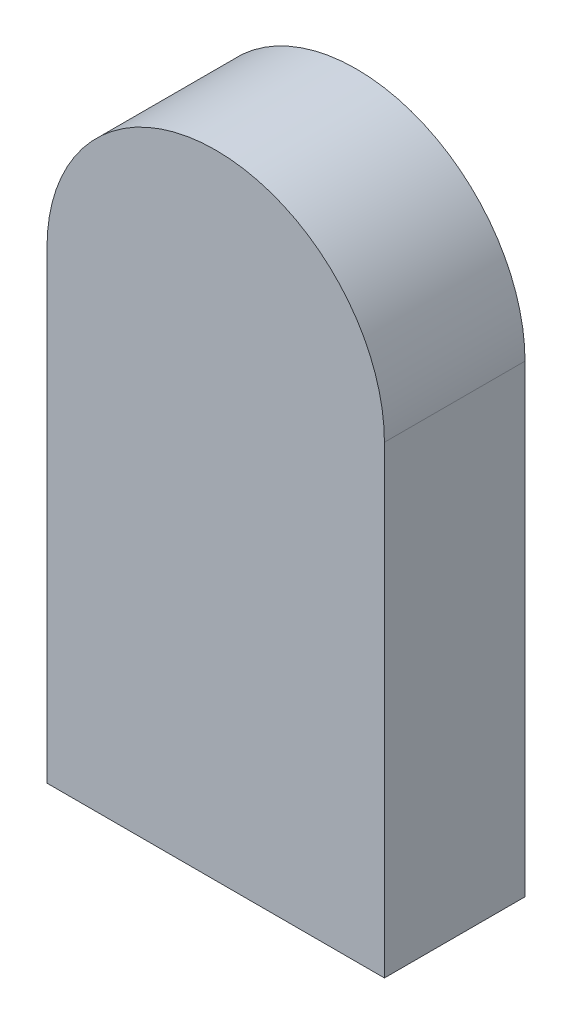
ISO-10303-21;
HEADER;
FILE_DESCRIPTION(('STEP AP214'),'2;1');
FILE_NAME('part.step','',(''),(''),'','','');
FILE_SCHEMA(('AUTOMOTIVE_DESIGN { 1 0 10303 214 1 1 1 1 }'));
ENDSEC;
DATA;
#1=APPLICATION_CONTEXT('core data for automotive mechanical design processes');
#2=APPLICATION_PROTOCOL_DEFINITION('international standard','automotive_design',2000,#1);
#3=PRODUCT_CONTEXT('',#1,'mechanical');
#4=PRODUCT('Part','Part','',(#3));
#5=PRODUCT_RELATED_PRODUCT_CATEGORY('part','',(#4));
#6=PRODUCT_DEFINITION_FORMATION('','',#4);
#7=PRODUCT_DEFINITION_CONTEXT('part definition',#1,'design');
#8=PRODUCT_DEFINITION('design','',#6,#7);
#9=PRODUCT_DEFINITION_SHAPE('','',#8);
#10=(LENGTH_UNIT() NAMED_UNIT(*) SI_UNIT(.MILLI.,.METRE.));
#11=(NAMED_UNIT(*) PLANE_ANGLE_UNIT() SI_UNIT($,.RADIAN.));
#12=(NAMED_UNIT(*) SI_UNIT($,.STERADIAN.) SOLID_ANGLE_UNIT());
#13=UNCERTAINTY_MEASURE_WITH_UNIT(LENGTH_MEASURE(1.E-05),#10,'distance_accuracy_value','');
#14=(GEOMETRIC_REPRESENTATION_CONTEXT(3) GLOBAL_UNCERTAINTY_ASSIGNED_CONTEXT((#13)) GLOBAL_UNIT_ASSIGNED_CONTEXT((#10,
#11,#12)) REPRESENTATION_CONTEXT('',''));
#15=CARTESIAN_POINT('',(0.,0.,0.));
#16=DIRECTION('',(0.,0.,1.));
#17=DIRECTION('',(1.,0.,0.));
#18=AXIS2_PLACEMENT_3D('',#15,#16,#17);
#19=CARTESIAN_POINT('',(-3.37,-4.05,0.));
#20=DIRECTION('',(0.,1.,0.));
#21=DIRECTION('',(1.,0.,0.));
#22=AXIS2_PLACEMENT_3D('',#19,#20,#21);
#23=PLANE('',#22);
#24=DIRECTION('',(1.,0.,0.));
#25=VECTOR('',#24,1.);
#26=CARTESIAN_POINT('',(-3.37,-4.05,0.));
#27=LINE('',#26,#25);
#28=CARTESIAN_POINT('',(-3.37,-4.05,0.));
#29=VERTEX_POINT('',#28);
#30=CARTESIAN_POINT('',(-3.13,-4.05,0.));
#31=VERTEX_POINT('',#30);
#32=EDGE_CURVE('E11',#29,#31,#27,.T.);
#33=ORIENTED_EDGE('',*,*,#32,.T.);
#34=DIRECTION('',(0.,0.,1.));
#35=VECTOR('',#34,1.);
#36=CARTESIAN_POINT('',(-3.13,-4.05,0.));
#37=LINE('',#36,#35);
#38=CARTESIAN_POINT('',(-3.13,-4.05,0.1));
#39=VERTEX_POINT('',#38);
#40=EDGE_CURVE('E24',#31,#39,#37,.T.);
#41=ORIENTED_EDGE('',*,*,#40,.T.);
#42=DIRECTION('',(1.,0.,0.));
#43=VECTOR('',#42,1.);
#44=CARTESIAN_POINT('',(-3.37,-4.05,0.1));
#45=LINE('',#44,#43);
#46=CARTESIAN_POINT('',(-3.37,-4.05,0.1));
#47=VERTEX_POINT('',#46);
#48=EDGE_CURVE('E87',#47,#39,#45,.T.);
#49=ORIENTED_EDGE('',*,*,#48,.F.);
#50=DIRECTION('',(0.,0.,1.));
#51=VECTOR('',#50,1.);
#52=CARTESIAN_POINT('',(-3.37,-4.05,0.));
#53=LINE('',#52,#51);
#54=EDGE_CURVE('E36',#29,#47,#53,.T.);
#55=ORIENTED_EDGE('',*,*,#54,.F.);
#56=EDGE_LOOP('',(#33,#41,#49,#55));
#57=FACE_BOUND('',#56,.T.);
#58=ADVANCED_FACE('F17',(#57),#23,.F.);
#59=CARTESIAN_POINT('',(-3.13,-4.05,0.));
#60=DIRECTION('',(-1.,0.,0.));
#61=DIRECTION('',(0.,1.,0.));
#62=AXIS2_PLACEMENT_3D('',#59,#60,#61);
#63=PLANE('',#62);
#64=DIRECTION('',(0.,1.,0.));
#65=VECTOR('',#64,1.);
#66=CARTESIAN_POINT('',(-3.13,-4.05,0.));
#67=LINE('',#66,#65);
#68=CARTESIAN_POINT('',(-3.13,-3.72,0.));
#69=VERTEX_POINT('',#68);
#70=EDGE_CURVE('E84',#31,#69,#67,.T.);
#71=ORIENTED_EDGE('',*,*,#70,.T.);
#72=DIRECTION('',(0.,0.,1.));
#73=VECTOR('',#72,1.);
#74=CARTESIAN_POINT('',(-3.13,-3.72,0.));
#75=LINE('',#74,#73);
#76=CARTESIAN_POINT('',(-3.13,-3.72,0.1));
#77=VERTEX_POINT('',#76);
#78=EDGE_CURVE('E82',#69,#77,#75,.T.);
#79=ORIENTED_EDGE('',*,*,#78,.T.);
#80=DIRECTION('',(0.,1.,0.));
#81=VECTOR('',#80,1.);
#82=CARTESIAN_POINT('',(-3.13,-4.05,0.1));
#83=LINE('',#82,#81);
#84=EDGE_CURVE('E72',#39,#77,#83,.T.);
#85=ORIENTED_EDGE('',*,*,#84,.F.);
#86=ORIENTED_EDGE('',*,*,#40,.F.);
#87=EDGE_LOOP('',(#71,#79,#85,#86));
#88=FACE_BOUND('',#87,.T.);
#89=ADVANCED_FACE('F89',(#88),#63,.F.);
#90=CARTESIAN_POINT('',(-3.25,-3.72,0.));
#91=DIRECTION('',(0.,0.,-1.));
#92=DIRECTION('',(1.,0.,0.));
#93=AXIS2_PLACEMENT_3D('',#90,#91,#92);
#94=CYLINDRICAL_SURFACE('',#93,0.12);
#95=CARTESIAN_POINT('',(-3.25,-3.72,0.));
#96=DIRECTION('',(0.,0.,1.));
#97=DIRECTION('',(1.,0.,0.));
#98=AXIS2_PLACEMENT_3D('',#95,#96,#97);
#99=CIRCLE('',#98,0.12);
#100=CARTESIAN_POINT('',(-3.37,-3.72,0.));
#101=VERTEX_POINT('',#100);
#102=EDGE_CURVE('E62',#69,#101,#99,.T.);
#103=ORIENTED_EDGE('',*,*,#102,.T.);
#104=DIRECTION('',(0.,0.,1.));
#105=VECTOR('',#104,1.);
#106=CARTESIAN_POINT('',(-3.37,-3.72,0.));
#107=LINE('',#106,#105);
#108=CARTESIAN_POINT('',(-3.37,-3.72,0.1));
#109=VERTEX_POINT('',#108);
#110=EDGE_CURVE('E57',#101,#109,#107,.T.);
#111=ORIENTED_EDGE('',*,*,#110,.T.);
#112=CARTESIAN_POINT('',(-3.25,-3.72,0.1));
#113=DIRECTION('',(0.,0.,1.));
#114=DIRECTION('',(1.,0.,0.));
#115=AXIS2_PLACEMENT_3D('',#112,#113,#114);
#116=CIRCLE('',#115,0.12);
#117=EDGE_CURVE('E60',#77,#109,#116,.T.);
#118=ORIENTED_EDGE('',*,*,#117,.F.);
#119=ORIENTED_EDGE('',*,*,#78,.F.);
#120=EDGE_LOOP('',(#103,#111,#118,#119));
#121=FACE_BOUND('',#120,.T.);
#122=ADVANCED_FACE('F59',(#121),#94,.T.);
#123=CARTESIAN_POINT('',(-3.37,-4.05,0.));
#124=DIRECTION('',(-1.,0.,0.));
#125=DIRECTION('',(0.,1.,0.));
#126=AXIS2_PLACEMENT_3D('',#123,#124,#125);
#127=PLANE('',#126);
#128=ORIENTED_EDGE('',*,*,#54,.T.);
#129=DIRECTION('',(0.,1.,0.));
#130=VECTOR('',#129,1.);
#131=CARTESIAN_POINT('',(-3.37,-4.05,0.1));
#132=LINE('',#131,#130);
#133=EDGE_CURVE('E71',#47,#109,#132,.T.);
#134=ORIENTED_EDGE('',*,*,#133,.T.);
#135=ORIENTED_EDGE('',*,*,#110,.F.);
#136=DIRECTION('',(0.,1.,0.));
#137=VECTOR('',#136,1.);
#138=CARTESIAN_POINT('',(-3.37,-4.05,0.));
#139=LINE('',#138,#137);
#140=EDGE_CURVE('E76',#29,#101,#139,.T.);
#141=ORIENTED_EDGE('',*,*,#140,.F.);
#142=EDGE_LOOP('',(#128,#134,#135,#141));
#143=FACE_BOUND('',#142,.T.);
#144=ADVANCED_FACE('F75',(#143),#127,.T.);
#145=CARTESIAN_POINT('',(-3.25,-3.849490847913,0.));
#146=DIRECTION('',(0.,0.,1.));
#147=DIRECTION('',(1.,0.,0.));
#148=AXIS2_PLACEMENT_3D('',#145,#146,#147);
#149=PLANE('',#148);
#150=ORIENTED_EDGE('',*,*,#140,.T.);
#151=ORIENTED_EDGE('',*,*,#102,.F.);
#152=ORIENTED_EDGE('',*,*,#70,.F.);
#153=ORIENTED_EDGE('',*,*,#32,.F.);
#154=EDGE_LOOP('',(#150,#151,#152,#153));
#155=FACE_BOUND('',#154,.T.);
#156=ADVANCED_FACE('F91',(#155),#149,.F.);
#157=CARTESIAN_POINT('',(-3.25,-3.849490847913,0.1));
#158=DIRECTION('',(0.,0.,1.));
#159=DIRECTION('',(1.,0.,0.));
#160=AXIS2_PLACEMENT_3D('',#157,#158,#159);
#161=PLANE('',#160);
#162=ORIENTED_EDGE('',*,*,#48,.T.);
#163=ORIENTED_EDGE('',*,*,#84,.T.);
#164=ORIENTED_EDGE('',*,*,#117,.T.);
#165=ORIENTED_EDGE('',*,*,#133,.F.);
#166=EDGE_LOOP('',(#162,#163,#164,#165));
#167=FACE_BOUND('',#166,.T.);
#168=ADVANCED_FACE('F70',(#167),#161,.T.);
#169=CLOSED_SHELL('',(#58,#89,#122,#144,#156,#168));
#170=MANIFOLD_SOLID_BREP('B1',#169);
#171=ADVANCED_BREP_SHAPE_REPRESENTATION('',(#18,#170),#14);
#172=SHAPE_DEFINITION_REPRESENTATION(#9,#171);
ENDSEC;
END-ISO-10303-21;
